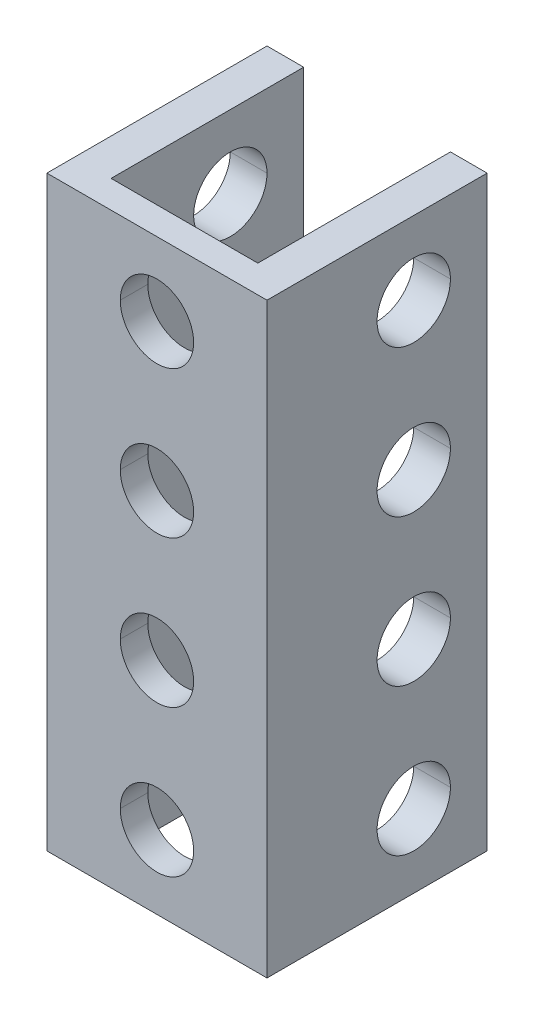
ISO-10303-21;
HEADER;
FILE_DESCRIPTION(('STEP AP214'),'2;1');
FILE_NAME('part.step','',(''),(''),'','','');
FILE_SCHEMA(('AUTOMOTIVE_DESIGN { 1 0 10303 214 1 1 1 1 }'));
ENDSEC;
DATA;
#1=APPLICATION_CONTEXT('core data for automotive mechanical design processes');
#2=APPLICATION_PROTOCOL_DEFINITION('international standard','automotive_design',2000,#1);
#3=PRODUCT_CONTEXT('',#1,'mechanical');
#4=PRODUCT('Part','Part','',(#3));
#5=PRODUCT_RELATED_PRODUCT_CATEGORY('part','',(#4));
#6=PRODUCT_DEFINITION_FORMATION('','',#4);
#7=PRODUCT_DEFINITION_CONTEXT('part definition',#1,'design');
#8=PRODUCT_DEFINITION('design','',#6,#7);
#9=PRODUCT_DEFINITION_SHAPE('','',#8);
#10=(LENGTH_UNIT() NAMED_UNIT(*) SI_UNIT(.MILLI.,.METRE.));
#11=(NAMED_UNIT(*) PLANE_ANGLE_UNIT() SI_UNIT($,.RADIAN.));
#12=(NAMED_UNIT(*) SI_UNIT($,.STERADIAN.) SOLID_ANGLE_UNIT());
#13=UNCERTAINTY_MEASURE_WITH_UNIT(LENGTH_MEASURE(1.E-05),#10,'distance_accuracy_value','');
#14=(GEOMETRIC_REPRESENTATION_CONTEXT(3) GLOBAL_UNCERTAINTY_ASSIGNED_CONTEXT((#13)) GLOBAL_UNIT_ASSIGNED_CONTEXT((#10,
#11,#12)) REPRESENTATION_CONTEXT('',''));
#15=CARTESIAN_POINT('',(0.,0.,0.));
#16=DIRECTION('',(0.,0.,1.));
#17=DIRECTION('',(1.,0.,0.));
#18=AXIS2_PLACEMENT_3D('',#15,#16,#17);
#19=CARTESIAN_POINT('',(0.,28.,1.5));
#20=DIRECTION('',(0.,0.,1.));
#21=DIRECTION('',(1.,0.,0.));
#22=AXIS2_PLACEMENT_3D('',#19,#20,#21);
#23=CYLINDRICAL_SURFACE('',#22,2.);
#24=DIRECTION('',(0.,0.,1.));
#25=VECTOR('',#24,1.);
#26=CARTESIAN_POINT('',(-2.,28.,1.5));
#27=LINE('',#26,#25);
#28=CARTESIAN_POINT('',(-2.,28.,0.));
#29=VERTEX_POINT('',#28);
#30=CARTESIAN_POINT('',(-2.,28.,1.5));
#31=VERTEX_POINT('',#30);
#32=EDGE_CURVE('E436',#29,#31,#27,.T.);
#33=ORIENTED_EDGE('',*,*,#32,.F.);
#34=CARTESIAN_POINT('',(0.,28.,0.));
#35=DIRECTION('',(0.,0.,1.));
#36=DIRECTION('',(1.,0.,0.));
#37=AXIS2_PLACEMENT_3D('',#34,#35,#36);
#38=CIRCLE('',#37,2.);
#39=CARTESIAN_POINT('',(2.,28.,0.));
#40=VERTEX_POINT('',#39);
#41=EDGE_CURVE('E483',#40,#29,#38,.T.);
#42=ORIENTED_EDGE('',*,*,#41,.F.);
#43=DIRECTION('',(0.,0.,1.));
#44=VECTOR('',#43,1.);
#45=CARTESIAN_POINT('',(2.,28.,1.5));
#46=LINE('',#45,#44);
#47=CARTESIAN_POINT('',(2.,28.,1.5));
#48=VERTEX_POINT('',#47);
#49=EDGE_CURVE('E472',#40,#48,#46,.T.);
#50=ORIENTED_EDGE('',*,*,#49,.T.);
#51=CARTESIAN_POINT('',(0.,28.,1.5));
#52=DIRECTION('',(0.,0.,1.));
#53=DIRECTION('',(1.,0.,0.));
#54=AXIS2_PLACEMENT_3D('',#51,#52,#53);
#55=CIRCLE('',#54,2.);
#56=EDGE_CURVE('E330',#48,#31,#55,.T.);
#57=ORIENTED_EDGE('',*,*,#56,.T.);
#58=EDGE_LOOP('',(#33,#42,#50,#57));
#59=FACE_BOUND('',#58,.T.);
#60=ADVANCED_FACE('F15',(#59),#23,.F.);
#61=CARTESIAN_POINT('',(0.,20.,1.5));
#62=DIRECTION('',(0.,0.,1.));
#63=DIRECTION('',(1.,0.,0.));
#64=AXIS2_PLACEMENT_3D('',#61,#62,#63);
#65=CYLINDRICAL_SURFACE('',#64,2.);
#66=DIRECTION('',(0.,0.,1.));
#67=VECTOR('',#66,1.);
#68=CARTESIAN_POINT('',(-2.,20.,1.5));
#69=LINE('',#68,#67);
#70=CARTESIAN_POINT('',(-2.,20.,0.));
#71=VERTEX_POINT('',#70);
#72=CARTESIAN_POINT('',(-2.,20.,1.5));
#73=VERTEX_POINT('',#72);
#74=EDGE_CURVE('E471',#71,#73,#69,.T.);
#75=ORIENTED_EDGE('',*,*,#74,.F.);
#76=CARTESIAN_POINT('',(0.,20.,0.));
#77=DIRECTION('',(0.,0.,1.));
#78=DIRECTION('',(1.,0.,0.));
#79=AXIS2_PLACEMENT_3D('',#76,#77,#78);
#80=CIRCLE('',#79,2.);
#81=CARTESIAN_POINT('',(2.,20.,0.));
#82=VERTEX_POINT('',#81);
#83=EDGE_CURVE('E486',#82,#71,#80,.T.);
#84=ORIENTED_EDGE('',*,*,#83,.F.);
#85=DIRECTION('',(0.,0.,1.));
#86=VECTOR('',#85,1.);
#87=CARTESIAN_POINT('',(2.,20.,1.5));
#88=LINE('',#87,#86);
#89=CARTESIAN_POINT('',(2.,20.,1.5));
#90=VERTEX_POINT('',#89);
#91=EDGE_CURVE('E427',#82,#90,#88,.T.);
#92=ORIENTED_EDGE('',*,*,#91,.T.);
#93=CARTESIAN_POINT('',(0.,20.,1.5));
#94=DIRECTION('',(0.,0.,1.));
#95=DIRECTION('',(1.,0.,0.));
#96=AXIS2_PLACEMENT_3D('',#93,#94,#95);
#97=CIRCLE('',#96,2.);
#98=EDGE_CURVE('E445',#90,#73,#97,.T.);
#99=ORIENTED_EDGE('',*,*,#98,.T.);
#100=EDGE_LOOP('',(#75,#84,#92,#99));
#101=FACE_BOUND('',#100,.T.);
#102=ADVANCED_FACE('F732',(#101),#65,.F.);
#103=CARTESIAN_POINT('',(0.,12.,1.5));
#104=DIRECTION('',(0.,0.,1.));
#105=DIRECTION('',(1.,0.,0.));
#106=AXIS2_PLACEMENT_3D('',#103,#104,#105);
#107=CYLINDRICAL_SURFACE('',#106,2.);
#108=DIRECTION('',(0.,0.,1.));
#109=VECTOR('',#108,1.);
#110=CARTESIAN_POINT('',(-2.,12.,1.5));
#111=LINE('',#110,#109);
#112=CARTESIAN_POINT('',(-2.,12.,0.));
#113=VERTEX_POINT('',#112);
#114=CARTESIAN_POINT('',(-2.,12.,1.5));
#115=VERTEX_POINT('',#114);
#116=EDGE_CURVE('E333',#113,#115,#111,.T.);
#117=ORIENTED_EDGE('',*,*,#116,.F.);
#118=CARTESIAN_POINT('',(0.,12.,0.));
#119=DIRECTION('',(0.,0.,1.));
#120=DIRECTION('',(1.,0.,0.));
#121=AXIS2_PLACEMENT_3D('',#118,#119,#120);
#122=CIRCLE('',#121,2.);
#123=CARTESIAN_POINT('',(2.,12.,0.));
#124=VERTEX_POINT('',#123);
#125=EDGE_CURVE('E26',#124,#113,#122,.T.);
#126=ORIENTED_EDGE('',*,*,#125,.F.);
#127=DIRECTION('',(0.,0.,1.));
#128=VECTOR('',#127,1.);
#129=CARTESIAN_POINT('',(2.,12.,1.5));
#130=LINE('',#129,#128);
#131=CARTESIAN_POINT('',(2.,12.,1.5));
#132=VERTEX_POINT('',#131);
#133=EDGE_CURVE('E390',#124,#132,#130,.T.);
#134=ORIENTED_EDGE('',*,*,#133,.T.);
#135=CARTESIAN_POINT('',(0.,12.,1.5));
#136=DIRECTION('',(0.,0.,1.));
#137=DIRECTION('',(1.,0.,0.));
#138=AXIS2_PLACEMENT_3D('',#135,#136,#137);
#139=CIRCLE('',#138,2.);
#140=EDGE_CURVE('E448',#132,#115,#139,.T.);
#141=ORIENTED_EDGE('',*,*,#140,.T.);
#142=EDGE_LOOP('',(#117,#126,#134,#141));
#143=FACE_BOUND('',#142,.T.);
#144=ADVANCED_FACE('F845',(#143),#107,.F.);
#145=CARTESIAN_POINT('',(-6.,28.,-6.5));
#146=DIRECTION('',(-1.,0.,0.));
#147=DIRECTION('',(0.,0.,1.));
#148=AXIS2_PLACEMENT_3D('',#145,#146,#147);
#149=CYLINDRICAL_SURFACE('',#148,2.);
#150=DIRECTION('',(-1.,0.,0.));
#151=VECTOR('',#150,1.);
#152=CARTESIAN_POINT('',(-6.,28.,-8.5));
#153=LINE('',#152,#151);
#154=CARTESIAN_POINT('',(6.,28.,-8.5));
#155=VERTEX_POINT('',#154);
#156=CARTESIAN_POINT('',(4.,28.,-8.5));
#157=VERTEX_POINT('',#156);
#158=EDGE_CURVE('E389',#155,#157,#153,.T.);
#159=ORIENTED_EDGE('',*,*,#158,.F.);
#160=CARTESIAN_POINT('',(6.,28.,-6.5));
#161=DIRECTION('',(-1.,0.,0.));
#162=DIRECTION('',(0.,0.,1.));
#163=AXIS2_PLACEMENT_3D('',#160,#161,#162);
#164=CIRCLE('',#163,2.);
#165=CARTESIAN_POINT('',(6.,28.,-4.5));
#166=VERTEX_POINT('',#165);
#167=EDGE_CURVE('E350',#166,#155,#164,.T.);
#168=ORIENTED_EDGE('',*,*,#167,.F.);
#169=DIRECTION('',(-1.,0.,0.));
#170=VECTOR('',#169,1.);
#171=CARTESIAN_POINT('',(-6.,28.,-4.5));
#172=LINE('',#171,#170);
#173=CARTESIAN_POINT('',(4.,28.,-4.5));
#174=VERTEX_POINT('',#173);
#175=EDGE_CURVE('E365',#166,#174,#172,.T.);
#176=ORIENTED_EDGE('',*,*,#175,.T.);
#177=CARTESIAN_POINT('',(4.,28.,-6.5));
#178=DIRECTION('',(1.,0.,0.));
#179=DIRECTION('',(0.,0.,-1.));
#180=AXIS2_PLACEMENT_3D('',#177,#178,#179);
#181=CIRCLE('',#180,2.);
#182=EDGE_CURVE('E455',#157,#174,#181,.T.);
#183=ORIENTED_EDGE('',*,*,#182,.F.);
#184=EDGE_LOOP('',(#159,#168,#176,#183));
#185=FACE_BOUND('',#184,.T.);
#186=ADVANCED_FACE('F840',(#185),#149,.F.);
#187=CARTESIAN_POINT('',(-6.,20.,-6.5));
#188=DIRECTION('',(-1.,0.,0.));
#189=DIRECTION('',(0.,0.,1.));
#190=AXIS2_PLACEMENT_3D('',#187,#188,#189);
#191=CYLINDRICAL_SURFACE('',#190,2.);
#192=DIRECTION('',(-1.,0.,0.));
#193=VECTOR('',#192,1.);
#194=CARTESIAN_POINT('',(-6.,20.,-8.5));
#195=LINE('',#194,#193);
#196=CARTESIAN_POINT('',(6.,20.,-8.5));
#197=VERTEX_POINT('',#196);
#198=CARTESIAN_POINT('',(4.,20.,-8.5));
#199=VERTEX_POINT('',#198);
#200=EDGE_CURVE('E364',#197,#199,#195,.T.);
#201=ORIENTED_EDGE('',*,*,#200,.F.);
#202=CARTESIAN_POINT('',(6.,20.,-6.5));
#203=DIRECTION('',(-1.,0.,0.));
#204=DIRECTION('',(0.,0.,1.));
#205=AXIS2_PLACEMENT_3D('',#202,#203,#204);
#206=CIRCLE('',#205,2.);
#207=CARTESIAN_POINT('',(6.,20.,-4.5));
#208=VERTEX_POINT('',#207);
#209=EDGE_CURVE('E354',#208,#197,#206,.T.);
#210=ORIENTED_EDGE('',*,*,#209,.F.);
#211=DIRECTION('',(-1.,0.,0.));
#212=VECTOR('',#211,1.);
#213=CARTESIAN_POINT('',(-6.,20.,-4.5));
#214=LINE('',#213,#212);
#215=CARTESIAN_POINT('',(4.,20.,-4.5));
#216=VERTEX_POINT('',#215);
#217=EDGE_CURVE('E510',#208,#216,#214,.T.);
#218=ORIENTED_EDGE('',*,*,#217,.T.);
#219=CARTESIAN_POINT('',(4.,20.,-6.5));
#220=DIRECTION('',(1.,0.,0.));
#221=DIRECTION('',(0.,0.,-1.));
#222=AXIS2_PLACEMENT_3D('',#219,#220,#221);
#223=CIRCLE('',#222,2.);
#224=EDGE_CURVE('E326',#199,#216,#223,.T.);
#225=ORIENTED_EDGE('',*,*,#224,.F.);
#226=EDGE_LOOP('',(#201,#210,#218,#225));
#227=FACE_BOUND('',#226,.T.);
#228=ADVANCED_FACE('F805',(#227),#191,.F.);
#229=CARTESIAN_POINT('',(-6.,12.,-6.5));
#230=DIRECTION('',(-1.,0.,0.));
#231=DIRECTION('',(0.,0.,1.));
#232=AXIS2_PLACEMENT_3D('',#229,#230,#231);
#233=CYLINDRICAL_SURFACE('',#232,2.);
#234=DIRECTION('',(-1.,0.,0.));
#235=VECTOR('',#234,1.);
#236=CARTESIAN_POINT('',(-6.,12.,-8.5));
#237=LINE('',#236,#235);
#238=CARTESIAN_POINT('',(6.,12.,-8.5));
#239=VERTEX_POINT('',#238);
#240=CARTESIAN_POINT('',(4.,12.,-8.5));
#241=VERTEX_POINT('',#240);
#242=EDGE_CURVE('E509',#239,#241,#237,.T.);
#243=ORIENTED_EDGE('',*,*,#242,.F.);
#244=CARTESIAN_POINT('',(6.,12.,-6.5));
#245=DIRECTION('',(-1.,0.,0.));
#246=DIRECTION('',(0.,0.,1.));
#247=AXIS2_PLACEMENT_3D('',#244,#245,#246);
#248=CIRCLE('',#247,2.);
#249=CARTESIAN_POINT('',(6.,12.,-4.5));
#250=VERTEX_POINT('',#249);
#251=EDGE_CURVE('E539',#250,#239,#248,.T.);
#252=ORIENTED_EDGE('',*,*,#251,.F.);
#253=DIRECTION('',(-1.,0.,0.));
#254=VECTOR('',#253,1.);
#255=CARTESIAN_POINT('',(-6.,12.,-4.5));
#256=LINE('',#255,#254);
#257=CARTESIAN_POINT('',(4.,12.,-4.5));
#258=VERTEX_POINT('',#257);
#259=EDGE_CURVE('E417',#250,#258,#256,.T.);
#260=ORIENTED_EDGE('',*,*,#259,.T.);
#261=CARTESIAN_POINT('',(4.,12.,-6.5));
#262=DIRECTION('',(1.,0.,0.));
#263=DIRECTION('',(0.,0.,-1.));
#264=AXIS2_PLACEMENT_3D('',#261,#262,#263);
#265=CIRCLE('',#264,2.);
#266=EDGE_CURVE('E397',#241,#258,#265,.T.);
#267=ORIENTED_EDGE('',*,*,#266,.F.);
#268=EDGE_LOOP('',(#243,#252,#260,#267));
#269=FACE_BOUND('',#268,.T.);
#270=ADVANCED_FACE('F799',(#269),#233,.F.);
#271=CARTESIAN_POINT('',(-6.,28.,-6.5));
#272=DIRECTION('',(-1.,0.,0.));
#273=DIRECTION('',(0.,0.,1.));
#274=AXIS2_PLACEMENT_3D('',#271,#272,#273);
#275=CYLINDRICAL_SURFACE('',#274,2.);
#276=DIRECTION('',(-1.,0.,0.));
#277=VECTOR('',#276,1.);
#278=CARTESIAN_POINT('',(-6.,28.,-8.5));
#279=LINE('',#278,#277);
#280=CARTESIAN_POINT('',(-4.,28.,-8.5));
#281=VERTEX_POINT('',#280);
#282=CARTESIAN_POINT('',(-6.,28.,-8.5));
#283=VERTEX_POINT('',#282);
#284=EDGE_CURVE('E476',#281,#283,#279,.T.);
#285=ORIENTED_EDGE('',*,*,#284,.F.);
#286=CARTESIAN_POINT('',(-4.,28.,-6.5));
#287=DIRECTION('',(-1.,0.,0.));
#288=DIRECTION('',(0.,0.,1.));
#289=AXIS2_PLACEMENT_3D('',#286,#287,#288);
#290=CIRCLE('',#289,2.);
#291=CARTESIAN_POINT('',(-4.,28.,-4.5));
#292=VERTEX_POINT('',#291);
#293=EDGE_CURVE('E345',#292,#281,#290,.T.);
#294=ORIENTED_EDGE('',*,*,#293,.F.);
#295=DIRECTION('',(-1.,0.,0.));
#296=VECTOR('',#295,1.);
#297=CARTESIAN_POINT('',(-6.,28.,-4.5));
#298=LINE('',#297,#296);
#299=CARTESIAN_POINT('',(-6.,28.,-4.5));
#300=VERTEX_POINT('',#299);
#301=EDGE_CURVE('E487',#292,#300,#298,.T.);
#302=ORIENTED_EDGE('',*,*,#301,.T.);
#303=CARTESIAN_POINT('',(-6.,28.,-6.5));
#304=DIRECTION('',(-1.,0.,0.));
#305=DIRECTION('',(0.,0.,1.));
#306=AXIS2_PLACEMENT_3D('',#303,#304,#305);
#307=CIRCLE('',#306,2.);
#308=EDGE_CURVE('E370',#300,#283,#307,.T.);
#309=ORIENTED_EDGE('',*,*,#308,.T.);
#310=EDGE_LOOP('',(#285,#294,#302,#309));
#311=FACE_BOUND('',#310,.T.);
#312=ADVANCED_FACE('F804',(#311),#275,.F.);
#313=CARTESIAN_POINT('',(-6.,20.,-6.5));
#314=DIRECTION('',(-1.,0.,0.));
#315=DIRECTION('',(0.,0.,1.));
#316=AXIS2_PLACEMENT_3D('',#313,#314,#315);
#317=CYLINDRICAL_SURFACE('',#316,2.);
#318=DIRECTION('',(-1.,0.,0.));
#319=VECTOR('',#318,1.);
#320=CARTESIAN_POINT('',(-6.,20.,-8.5));
#321=LINE('',#320,#319);
#322=CARTESIAN_POINT('',(-4.,20.,-8.5));
#323=VERTEX_POINT('',#322);
#324=CARTESIAN_POINT('',(-6.,20.,-8.5));
#325=VERTEX_POINT('',#324);
#326=EDGE_CURVE('E544',#323,#325,#321,.T.);
#327=ORIENTED_EDGE('',*,*,#326,.F.);
#328=CARTESIAN_POINT('',(-4.,20.,-6.5));
#329=DIRECTION('',(-1.,0.,0.));
#330=DIRECTION('',(0.,0.,1.));
#331=AXIS2_PLACEMENT_3D('',#328,#329,#330);
#332=CIRCLE('',#331,2.);
#333=CARTESIAN_POINT('',(-4.,20.,-4.5));
#334=VERTEX_POINT('',#333);
#335=EDGE_CURVE('E349',#334,#323,#332,.T.);
#336=ORIENTED_EDGE('',*,*,#335,.F.);
#337=DIRECTION('',(-1.,0.,0.));
#338=VECTOR('',#337,1.);
#339=CARTESIAN_POINT('',(-6.,20.,-4.5));
#340=LINE('',#339,#338);
#341=CARTESIAN_POINT('',(-6.,20.,-4.5));
#342=VERTEX_POINT('',#341);
#343=EDGE_CURVE('E578',#334,#342,#340,.T.);
#344=ORIENTED_EDGE('',*,*,#343,.T.);
#345=CARTESIAN_POINT('',(-6.,20.,-6.5));
#346=DIRECTION('',(-1.,0.,0.));
#347=DIRECTION('',(0.,0.,1.));
#348=AXIS2_PLACEMENT_3D('',#345,#346,#347);
#349=CIRCLE('',#348,2.);
#350=EDGE_CURVE('E303',#342,#325,#349,.T.);
#351=ORIENTED_EDGE('',*,*,#350,.T.);
#352=EDGE_LOOP('',(#327,#336,#344,#351));
#353=FACE_BOUND('',#352,.T.);
#354=ADVANCED_FACE('F886',(#353),#317,.F.);
#355=CARTESIAN_POINT('',(-6.,12.,-6.5));
#356=DIRECTION('',(-1.,0.,0.));
#357=DIRECTION('',(0.,0.,1.));
#358=AXIS2_PLACEMENT_3D('',#355,#356,#357);
#359=CYLINDRICAL_SURFACE('',#358,2.);
#360=DIRECTION('',(-1.,0.,0.));
#361=VECTOR('',#360,1.);
#362=CARTESIAN_POINT('',(-6.,12.,-8.5));
#363=LINE('',#362,#361);
#364=CARTESIAN_POINT('',(-4.,12.,-8.5));
#365=VERTEX_POINT('',#364);
#366=CARTESIAN_POINT('',(-6.,12.,-8.5));
#367=VERTEX_POINT('',#366);
#368=EDGE_CURVE('E549',#365,#367,#363,.T.);
#369=ORIENTED_EDGE('',*,*,#368,.F.);
#370=CARTESIAN_POINT('',(-4.,12.,-6.5));
#371=DIRECTION('',(-1.,0.,0.));
#372=DIRECTION('',(0.,0.,1.));
#373=AXIS2_PLACEMENT_3D('',#370,#371,#372);
#374=CIRCLE('',#373,2.);
#375=CARTESIAN_POINT('',(-4.,12.,-4.5));
#376=VERTEX_POINT('',#375);
#377=EDGE_CURVE('E355',#376,#365,#374,.T.);
#378=ORIENTED_EDGE('',*,*,#377,.F.);
#379=DIRECTION('',(-1.,0.,0.));
#380=VECTOR('',#379,1.);
#381=CARTESIAN_POINT('',(-6.,12.,-4.5));
#382=LINE('',#381,#380);
#383=CARTESIAN_POINT('',(-6.,12.,-4.5));
#384=VERTEX_POINT('',#383);
#385=EDGE_CURVE('E535',#376,#384,#382,.T.);
#386=ORIENTED_EDGE('',*,*,#385,.T.);
#387=CARTESIAN_POINT('',(-6.,12.,-6.5));
#388=DIRECTION('',(-1.,0.,0.));
#389=DIRECTION('',(0.,0.,1.));
#390=AXIS2_PLACEMENT_3D('',#387,#388,#389);
#391=CIRCLE('',#390,2.);
#392=EDGE_CURVE('E304',#384,#367,#391,.T.);
#393=ORIENTED_EDGE('',*,*,#392,.T.);
#394=EDGE_LOOP('',(#369,#378,#386,#393));
#395=FACE_BOUND('',#394,.T.);
#396=ADVANCED_FACE('F697',(#395),#359,.F.);
#397=CARTESIAN_POINT('',(0.,32.,0.));
#398=DIRECTION('',(0.,1.,0.));
#399=DIRECTION('',(1.,0.,0.));
#400=AXIS2_PLACEMENT_3D('',#397,#398,#399);
#401=PLANE('',#400);
#402=DIRECTION('',(0.,0.,-1.));
#403=VECTOR('',#402,1.);
#404=CARTESIAN_POINT('',(-4.,32.,0.));
#405=LINE('',#404,#403);
#406=CARTESIAN_POINT('',(-4.,32.,0.));
#407=VERTEX_POINT('',#406);
#408=CARTESIAN_POINT('',(-4.,32.,-10.5));
#409=VERTEX_POINT('',#408);
#410=EDGE_CURVE('E480',#407,#409,#405,.T.);
#411=ORIENTED_EDGE('',*,*,#410,.T.);
#412=DIRECTION('',(-1.,0.,0.));
#413=VECTOR('',#412,1.);
#414=CARTESIAN_POINT('',(-4.,32.,-10.5));
#415=LINE('',#414,#413);
#416=CARTESIAN_POINT('',(-6.,32.,-10.5));
#417=VERTEX_POINT('',#416);
#418=EDGE_CURVE('E374',#409,#417,#415,.T.);
#419=ORIENTED_EDGE('',*,*,#418,.T.);
#420=DIRECTION('',(0.,0.,1.));
#421=VECTOR('',#420,1.);
#422=CARTESIAN_POINT('',(-6.,32.,-10.5));
#423=LINE('',#422,#421);
#424=CARTESIAN_POINT('',(-6.,32.,1.5));
#425=VERTEX_POINT('',#424);
#426=EDGE_CURVE('E520',#417,#425,#423,.T.);
#427=ORIENTED_EDGE('',*,*,#426,.T.);
#428=DIRECTION('',(1.,0.,0.));
#429=VECTOR('',#428,1.);
#430=CARTESIAN_POINT('',(-6.,32.,1.5));
#431=LINE('',#430,#429);
#432=CARTESIAN_POINT('',(6.,32.,1.5));
#433=VERTEX_POINT('',#432);
#434=EDGE_CURVE('E328',#425,#433,#431,.T.);
#435=ORIENTED_EDGE('',*,*,#434,.T.);
#436=DIRECTION('',(0.,0.,-1.));
#437=VECTOR('',#436,1.);
#438=CARTESIAN_POINT('',(6.,32.,-10.5));
#439=LINE('',#438,#437);
#440=CARTESIAN_POINT('',(6.,32.,-10.5));
#441=VERTEX_POINT('',#440);
#442=EDGE_CURVE('E461',#433,#441,#439,.T.);
#443=ORIENTED_EDGE('',*,*,#442,.T.);
#444=DIRECTION('',(-1.,0.,0.));
#445=VECTOR('',#444,1.);
#446=CARTESIAN_POINT('',(4.,32.,-10.5));
#447=LINE('',#446,#445);
#448=CARTESIAN_POINT('',(4.,32.,-10.5));
#449=VERTEX_POINT('',#448);
#450=EDGE_CURVE('E569',#441,#449,#447,.T.);
#451=ORIENTED_EDGE('',*,*,#450,.T.);
#452=DIRECTION('',(0.,0.,1.));
#453=VECTOR('',#452,1.);
#454=CARTESIAN_POINT('',(4.,32.,0.));
#455=LINE('',#454,#453);
#456=CARTESIAN_POINT('',(4.,32.,0.));
#457=VERTEX_POINT('',#456);
#458=EDGE_CURVE('E401',#449,#457,#455,.T.);
#459=ORIENTED_EDGE('',*,*,#458,.T.);
#460=DIRECTION('',(-1.,0.,0.));
#461=VECTOR('',#460,1.);
#462=CARTESIAN_POINT('',(4.,32.,0.));
#463=LINE('',#462,#461);
#464=EDGE_CURVE('E40',#457,#407,#463,.T.);
#465=ORIENTED_EDGE('',*,*,#464,.T.);
#466=EDGE_LOOP('',(#411,#419,#427,#435,#443,#451,#459,#465));
#467=FACE_BOUND('',#466,.T.);
#468=ADVANCED_FACE('F605',(#467),#401,.T.);
#469=CARTESIAN_POINT('',(0.,4.,1.5));
#470=DIRECTION('',(0.,0.,1.));
#471=DIRECTION('',(1.,0.,0.));
#472=AXIS2_PLACEMENT_3D('',#469,#470,#471);
#473=CYLINDRICAL_SURFACE('',#472,2.);
#474=DIRECTION('',(0.,0.,1.));
#475=VECTOR('',#474,1.);
#476=CARTESIAN_POINT('',(-2.,4.,1.5));
#477=LINE('',#476,#475);
#478=CARTESIAN_POINT('',(-2.,4.,0.));
#479=VERTEX_POINT('',#478);
#480=CARTESIAN_POINT('',(-2.,4.,1.5));
#481=VERTEX_POINT('',#480);
#482=EDGE_CURVE('E501',#479,#481,#477,.T.);
#483=ORIENTED_EDGE('',*,*,#482,.F.);
#484=CARTESIAN_POINT('',(0.,4.,0.));
#485=DIRECTION('',(0.,0.,1.));
#486=DIRECTION('',(1.,0.,0.));
#487=AXIS2_PLACEMENT_3D('',#484,#485,#486);
#488=CIRCLE('',#487,2.);
#489=CARTESIAN_POINT('',(2.,4.,0.));
#490=VERTEX_POINT('',#489);
#491=EDGE_CURVE('E10',#490,#479,#488,.T.);
#492=ORIENTED_EDGE('',*,*,#491,.F.);
#493=DIRECTION('',(0.,0.,1.));
#494=VECTOR('',#493,1.);
#495=CARTESIAN_POINT('',(2.,4.,1.5));
#496=LINE('',#495,#494);
#497=CARTESIAN_POINT('',(2.,4.,1.5));
#498=VERTEX_POINT('',#497);
#499=EDGE_CURVE('E322',#490,#498,#496,.T.);
#500=ORIENTED_EDGE('',*,*,#499,.T.);
#501=CARTESIAN_POINT('',(0.,4.,1.5));
#502=DIRECTION('',(0.,0.,1.));
#503=DIRECTION('',(1.,0.,0.));
#504=AXIS2_PLACEMENT_3D('',#501,#502,#503);
#505=CIRCLE('',#504,2.);
#506=EDGE_CURVE('E416',#498,#481,#505,.T.);
#507=ORIENTED_EDGE('',*,*,#506,.T.);
#508=EDGE_LOOP('',(#483,#492,#500,#507));
#509=FACE_BOUND('',#508,.T.);
#510=ADVANCED_FACE('F696',(#509),#473,.F.);
#511=CARTESIAN_POINT('',(-6.,4.,-6.5));
#512=DIRECTION('',(-1.,0.,0.));
#513=DIRECTION('',(0.,0.,1.));
#514=AXIS2_PLACEMENT_3D('',#511,#512,#513);
#515=CYLINDRICAL_SURFACE('',#514,2.);
#516=DIRECTION('',(-1.,0.,0.));
#517=VECTOR('',#516,1.);
#518=CARTESIAN_POINT('',(-6.,4.,-8.5));
#519=LINE('',#518,#517);
#520=CARTESIAN_POINT('',(-4.,4.,-8.5));
#521=VERTEX_POINT('',#520);
#522=CARTESIAN_POINT('',(-6.,4.,-8.5));
#523=VERTEX_POINT('',#522);
#524=EDGE_CURVE('E296',#521,#523,#519,.T.);
#525=ORIENTED_EDGE('',*,*,#524,.F.);
#526=CARTESIAN_POINT('',(-4.,4.,-6.5));
#527=DIRECTION('',(-1.,0.,0.));
#528=DIRECTION('',(0.,0.,1.));
#529=AXIS2_PLACEMENT_3D('',#526,#527,#528);
#530=CIRCLE('',#529,2.);
#531=CARTESIAN_POINT('',(-4.,4.,-4.5));
#532=VERTEX_POINT('',#531);
#533=EDGE_CURVE('E358',#532,#521,#530,.T.);
#534=ORIENTED_EDGE('',*,*,#533,.F.);
#535=DIRECTION('',(-1.,0.,0.));
#536=VECTOR('',#535,1.);
#537=CARTESIAN_POINT('',(-6.,4.,-4.5));
#538=LINE('',#537,#536);
#539=CARTESIAN_POINT('',(-6.,4.,-4.5));
#540=VERTEX_POINT('',#539);
#541=EDGE_CURVE('E299',#532,#540,#538,.T.);
#542=ORIENTED_EDGE('',*,*,#541,.T.);
#543=CARTESIAN_POINT('',(-6.,4.,-6.5));
#544=DIRECTION('',(-1.,0.,0.));
#545=DIRECTION('',(0.,0.,1.));
#546=AXIS2_PLACEMENT_3D('',#543,#544,#545);
#547=CIRCLE('',#546,2.);
#548=EDGE_CURVE('E292',#540,#523,#547,.T.);
#549=ORIENTED_EDGE('',*,*,#548,.T.);
#550=EDGE_LOOP('',(#525,#534,#542,#549));
#551=FACE_BOUND('',#550,.T.);
#552=ADVANCED_FACE('F294',(#551),#515,.F.);
#553=CARTESIAN_POINT('',(-6.,4.,-6.5));
#554=DIRECTION('',(-1.,0.,0.));
#555=DIRECTION('',(0.,0.,1.));
#556=AXIS2_PLACEMENT_3D('',#553,#554,#555);
#557=CYLINDRICAL_SURFACE('',#556,2.);
#558=DIRECTION('',(-1.,0.,0.));
#559=VECTOR('',#558,1.);
#560=CARTESIAN_POINT('',(-6.,4.,-8.5));
#561=LINE('',#560,#559);
#562=CARTESIAN_POINT('',(6.,4.,-8.5));
#563=VERTEX_POINT('',#562);
#564=CARTESIAN_POINT('',(4.,4.,-8.5));
#565=VERTEX_POINT('',#564);
#566=EDGE_CURVE('E380',#563,#565,#561,.T.);
#567=ORIENTED_EDGE('',*,*,#566,.F.);
#568=CARTESIAN_POINT('',(6.,4.,-6.5));
#569=DIRECTION('',(-1.,0.,0.));
#570=DIRECTION('',(0.,0.,1.));
#571=AXIS2_PLACEMENT_3D('',#568,#569,#570);
#572=CIRCLE('',#571,2.);
#573=CARTESIAN_POINT('',(6.,4.,-4.5));
#574=VERTEX_POINT('',#573);
#575=EDGE_CURVE('E530',#574,#563,#572,.T.);
#576=ORIENTED_EDGE('',*,*,#575,.F.);
#577=DIRECTION('',(-1.,0.,0.));
#578=VECTOR('',#577,1.);
#579=CARTESIAN_POINT('',(-6.,4.,-4.5));
#580=LINE('',#579,#578);
#581=CARTESIAN_POINT('',(4.,4.,-4.5));
#582=VERTEX_POINT('',#581);
#583=EDGE_CURVE('E339',#574,#582,#580,.T.);
#584=ORIENTED_EDGE('',*,*,#583,.T.);
#585=CARTESIAN_POINT('',(4.,4.,-6.5));
#586=DIRECTION('',(1.,0.,0.));
#587=DIRECTION('',(0.,0.,-1.));
#588=AXIS2_PLACEMENT_3D('',#585,#586,#587);
#589=CIRCLE('',#588,2.);
#590=EDGE_CURVE('E400',#565,#582,#589,.T.);
#591=ORIENTED_EDGE('',*,*,#590,.F.);
#592=EDGE_LOOP('',(#567,#576,#584,#591));
#593=FACE_BOUND('',#592,.T.);
#594=ADVANCED_FACE('F720',(#593),#557,.F.);
#595=CARTESIAN_POINT('',(0.,0.,0.));
#596=DIRECTION('',(0.,1.,0.));
#597=DIRECTION('',(1.,0.,0.));
#598=AXIS2_PLACEMENT_3D('',#595,#596,#597);
#599=PLANE('',#598);
#600=DIRECTION('',(0.,0.,-1.));
#601=VECTOR('',#600,1.);
#602=CARTESIAN_POINT('',(-4.,0.,0.));
#603=LINE('',#602,#601);
#604=CARTESIAN_POINT('',(-4.,0.,0.));
#605=VERTEX_POINT('',#604);
#606=CARTESIAN_POINT('',(-4.,0.,-10.5));
#607=VERTEX_POINT('',#606);
#608=EDGE_CURVE('E343',#605,#607,#603,.T.);
#609=ORIENTED_EDGE('',*,*,#608,.F.);
#610=DIRECTION('',(-1.,0.,0.));
#611=VECTOR('',#610,1.);
#612=CARTESIAN_POINT('',(4.,0.,0.));
#613=LINE('',#612,#611);
#614=CARTESIAN_POINT('',(4.,0.,0.));
#615=VERTEX_POINT('',#614);
#616=EDGE_CURVE('E452',#615,#605,#613,.T.);
#617=ORIENTED_EDGE('',*,*,#616,.F.);
#618=DIRECTION('',(0.,0.,1.));
#619=VECTOR('',#618,1.);
#620=CARTESIAN_POINT('',(4.,0.,0.));
#621=LINE('',#620,#619);
#622=CARTESIAN_POINT('',(4.,0.,-10.5));
#623=VERTEX_POINT('',#622);
#624=EDGE_CURVE('E565',#623,#615,#621,.T.);
#625=ORIENTED_EDGE('',*,*,#624,.F.);
#626=DIRECTION('',(-1.,0.,0.));
#627=VECTOR('',#626,1.);
#628=CARTESIAN_POINT('',(4.,0.,-10.5));
#629=LINE('',#628,#627);
#630=CARTESIAN_POINT('',(6.,0.,-10.5));
#631=VERTEX_POINT('',#630);
#632=EDGE_CURVE('E353',#631,#623,#629,.T.);
#633=ORIENTED_EDGE('',*,*,#632,.F.);
#634=DIRECTION('',(0.,0.,-1.));
#635=VECTOR('',#634,1.);
#636=CARTESIAN_POINT('',(6.,0.,-10.5));
#637=LINE('',#636,#635);
#638=CARTESIAN_POINT('',(6.,0.,1.5));
#639=VERTEX_POINT('',#638);
#640=EDGE_CURVE('E411',#639,#631,#637,.T.);
#641=ORIENTED_EDGE('',*,*,#640,.F.);
#642=DIRECTION('',(1.,0.,0.));
#643=VECTOR('',#642,1.);
#644=CARTESIAN_POINT('',(-6.,0.,1.5));
#645=LINE('',#644,#643);
#646=CARTESIAN_POINT('',(-6.,0.,1.5));
#647=VERTEX_POINT('',#646);
#648=EDGE_CURVE('E372',#647,#639,#645,.T.);
#649=ORIENTED_EDGE('',*,*,#648,.F.);
#650=DIRECTION('',(0.,0.,1.));
#651=VECTOR('',#650,1.);
#652=CARTESIAN_POINT('',(-6.,0.,-10.5));
#653=LINE('',#652,#651);
#654=CARTESIAN_POINT('',(-6.,0.,-10.5));
#655=VERTEX_POINT('',#654);
#656=EDGE_CURVE('E378',#655,#647,#653,.T.);
#657=ORIENTED_EDGE('',*,*,#656,.F.);
#658=DIRECTION('',(-1.,0.,0.));
#659=VECTOR('',#658,1.);
#660=CARTESIAN_POINT('',(-4.,0.,-10.5));
#661=LINE('',#660,#659);
#662=EDGE_CURVE('E348',#607,#655,#661,.T.);
#663=ORIENTED_EDGE('',*,*,#662,.F.);
#664=EDGE_LOOP('',(#609,#617,#625,#633,#641,#649,#657,#663));
#665=FACE_BOUND('',#664,.T.);
#666=ADVANCED_FACE('F600',(#665),#599,.F.);
#667=CARTESIAN_POINT('',(4.,8.,0.));
#668=DIRECTION('',(0.,0.,1.));
#669=DIRECTION('',(1.,0.,0.));
#670=AXIS2_PLACEMENT_3D('',#667,#668,#669);
#671=PLANE('',#670);
#672=ORIENTED_EDGE('',*,*,#491,.T.);
#673=CARTESIAN_POINT('',(0.,4.,0.));
#674=DIRECTION('',(0.,0.,1.));
#675=DIRECTION('',(1.,0.,0.));
#676=AXIS2_PLACEMENT_3D('',#673,#674,#675);
#677=CIRCLE('',#676,2.);
#678=EDGE_CURVE('E531',#479,#490,#677,.T.);
#679=ORIENTED_EDGE('',*,*,#678,.T.);
#680=EDGE_LOOP('',(#672,#679));
#681=FACE_BOUND('',#680,.T.);
#682=ORIENTED_EDGE('',*,*,#125,.T.);
#683=CARTESIAN_POINT('',(0.,12.,0.));
#684=DIRECTION('',(0.,0.,1.));
#685=DIRECTION('',(1.,0.,0.));
#686=AXIS2_PLACEMENT_3D('',#683,#684,#685);
#687=CIRCLE('',#686,2.);
#688=EDGE_CURVE('E338',#113,#124,#687,.T.);
#689=ORIENTED_EDGE('',*,*,#688,.T.);
#690=EDGE_LOOP('',(#682,#689));
#691=FACE_BOUND('',#690,.T.);
#692=ORIENTED_EDGE('',*,*,#83,.T.);
#693=CARTESIAN_POINT('',(0.,20.,0.));
#694=DIRECTION('',(0.,0.,1.));
#695=DIRECTION('',(1.,0.,0.));
#696=AXIS2_PLACEMENT_3D('',#693,#694,#695);
#697=CIRCLE('',#696,2.);
#698=EDGE_CURVE('E467',#71,#82,#697,.T.);
#699=ORIENTED_EDGE('',*,*,#698,.T.);
#700=EDGE_LOOP('',(#692,#699));
#701=FACE_BOUND('',#700,.T.);
#702=ORIENTED_EDGE('',*,*,#41,.T.);
#703=CARTESIAN_POINT('',(0.,28.,0.));
#704=DIRECTION('',(0.,0.,1.));
#705=DIRECTION('',(1.,0.,0.));
#706=AXIS2_PLACEMENT_3D('',#703,#704,#705);
#707=CIRCLE('',#706,2.);
#708=EDGE_CURVE('E441',#29,#40,#707,.T.);
#709=ORIENTED_EDGE('',*,*,#708,.T.);
#710=EDGE_LOOP('',(#702,#709));
#711=FACE_BOUND('',#710,.T.);
#712=ORIENTED_EDGE('',*,*,#616,.T.);
#713=DIRECTION('',(0.,-1.,0.));
#714=VECTOR('',#713,1.);
#715=CARTESIAN_POINT('',(-4.,8.,0.));
#716=LINE('',#715,#714);
#717=EDGE_CURVE('E359',#407,#605,#716,.T.);
#718=ORIENTED_EDGE('',*,*,#717,.F.);
#719=ORIENTED_EDGE('',*,*,#464,.F.);
#720=DIRECTION('',(0.,-1.,0.));
#721=VECTOR('',#720,1.);
#722=CARTESIAN_POINT('',(4.,8.,0.));
#723=LINE('',#722,#721);
#724=EDGE_CURVE('E451',#457,#615,#723,.T.);
#725=ORIENTED_EDGE('',*,*,#724,.T.);
#726=EDGE_LOOP('',(#712,#718,#719,#725));
#727=FACE_BOUND('',#726,.T.);
#728=ADVANCED_FACE('F610',(#681,#691,#701,#711,#727),#671,.F.);
#729=CARTESIAN_POINT('',(4.,8.,0.));
#730=DIRECTION('',(1.,0.,0.));
#731=DIRECTION('',(0.,1.,0.));
#732=AXIS2_PLACEMENT_3D('',#729,#730,#731);
#733=PLANE('',#732);
#734=CARTESIAN_POINT('',(4.,28.,-6.5));
#735=DIRECTION('',(1.,0.,0.));
#736=DIRECTION('',(0.,0.,-1.));
#737=AXIS2_PLACEMENT_3D('',#734,#735,#736);
#738=CIRCLE('',#737,2.);
#739=EDGE_CURVE('E435',#174,#157,#738,.T.);
#740=ORIENTED_EDGE('',*,*,#739,.T.);
#741=ORIENTED_EDGE('',*,*,#182,.T.);
#742=EDGE_LOOP('',(#740,#741));
#743=FACE_BOUND('',#742,.T.);
#744=CARTESIAN_POINT('',(4.,20.,-6.5));
#745=DIRECTION('',(1.,0.,0.));
#746=DIRECTION('',(0.,0.,-1.));
#747=AXIS2_PLACEMENT_3D('',#744,#745,#746);
#748=CIRCLE('',#747,2.);
#749=EDGE_CURVE('E543',#216,#199,#748,.T.);
#750=ORIENTED_EDGE('',*,*,#749,.T.);
#751=ORIENTED_EDGE('',*,*,#224,.T.);
#752=EDGE_LOOP('',(#750,#751));
#753=FACE_BOUND('',#752,.T.);
#754=CARTESIAN_POINT('',(4.,4.,-6.5));
#755=DIRECTION('',(1.,0.,0.));
#756=DIRECTION('',(0.,0.,-1.));
#757=AXIS2_PLACEMENT_3D('',#754,#755,#756);
#758=CIRCLE('',#757,2.);
#759=EDGE_CURVE('E344',#582,#565,#758,.T.);
#760=ORIENTED_EDGE('',*,*,#759,.T.);
#761=ORIENTED_EDGE('',*,*,#590,.T.);
#762=EDGE_LOOP('',(#760,#761));
#763=FACE_BOUND('',#762,.T.);
#764=CARTESIAN_POINT('',(4.,12.,-6.5));
#765=DIRECTION('',(1.,0.,0.));
#766=DIRECTION('',(0.,0.,-1.));
#767=AXIS2_PLACEMENT_3D('',#764,#765,#766);
#768=CIRCLE('',#767,2.);
#769=EDGE_CURVE('E422',#258,#241,#768,.T.);
#770=ORIENTED_EDGE('',*,*,#769,.T.);
#771=ORIENTED_EDGE('',*,*,#266,.T.);
#772=EDGE_LOOP('',(#770,#771));
#773=FACE_BOUND('',#772,.T.);
#774=ORIENTED_EDGE('',*,*,#624,.T.);
#775=ORIENTED_EDGE('',*,*,#724,.F.);
#776=ORIENTED_EDGE('',*,*,#458,.F.);
#777=DIRECTION('',(0.,-1.,0.));
#778=VECTOR('',#777,1.);
#779=CARTESIAN_POINT('',(4.,8.,-10.5));
#780=LINE('',#779,#778);
#781=EDGE_CURVE('E426',#449,#623,#780,.T.);
#782=ORIENTED_EDGE('',*,*,#781,.T.);
#783=EDGE_LOOP('',(#774,#775,#776,#782));
#784=FACE_BOUND('',#783,.T.);
#785=ADVANCED_FACE('F615',(#743,#753,#763,#773,#784),#733,.F.);
#786=CARTESIAN_POINT('',(4.,8.,-10.5));
#787=DIRECTION('',(0.,0.,1.));
#788=DIRECTION('',(1.,0.,0.));
#789=AXIS2_PLACEMENT_3D('',#786,#787,#788);
#790=PLANE('',#789);
#791=ORIENTED_EDGE('',*,*,#632,.T.);
#792=ORIENTED_EDGE('',*,*,#781,.F.);
#793=ORIENTED_EDGE('',*,*,#450,.F.);
#794=DIRECTION('',(0.,-1.,0.));
#795=VECTOR('',#794,1.);
#796=CARTESIAN_POINT('',(6.,8.,-10.5));
#797=LINE('',#796,#795);
#798=EDGE_CURVE('E415',#441,#631,#797,.T.);
#799=ORIENTED_EDGE('',*,*,#798,.T.);
#800=EDGE_LOOP('',(#791,#792,#793,#799));
#801=FACE_BOUND('',#800,.T.);
#802=ADVANCED_FACE('F619',(#801),#790,.F.);
#803=CARTESIAN_POINT('',(6.,8.,-10.5));
#804=DIRECTION('',(-1.,0.,0.));
#805=DIRECTION('',(0.,0.,1.));
#806=AXIS2_PLACEMENT_3D('',#803,#804,#805);
#807=PLANE('',#806);
#808=ORIENTED_EDGE('',*,*,#167,.T.);
#809=CARTESIAN_POINT('',(6.,28.,-6.5));
#810=DIRECTION('',(-1.,0.,0.));
#811=DIRECTION('',(0.,0.,1.));
#812=AXIS2_PLACEMENT_3D('',#809,#810,#811);
#813=CIRCLE('',#812,2.);
#814=EDGE_CURVE('E385',#155,#166,#813,.T.);
#815=ORIENTED_EDGE('',*,*,#814,.T.);
#816=EDGE_LOOP('',(#808,#815));
#817=FACE_BOUND('',#816,.T.);
#818=ORIENTED_EDGE('',*,*,#209,.T.);
#819=CARTESIAN_POINT('',(6.,20.,-6.5));
#820=DIRECTION('',(-1.,0.,0.));
#821=DIRECTION('',(0.,0.,1.));
#822=AXIS2_PLACEMENT_3D('',#819,#820,#821);
#823=CIRCLE('',#822,2.);
#824=EDGE_CURVE('E360',#197,#208,#823,.T.);
#825=ORIENTED_EDGE('',*,*,#824,.T.);
#826=EDGE_LOOP('',(#818,#825));
#827=FACE_BOUND('',#826,.T.);
#828=ORIENTED_EDGE('',*,*,#575,.T.);
#829=CARTESIAN_POINT('',(6.,4.,-6.5));
#830=DIRECTION('',(-1.,0.,0.));
#831=DIRECTION('',(0.,0.,1.));
#832=AXIS2_PLACEMENT_3D('',#829,#830,#831);
#833=CIRCLE('',#832,2.);
#834=EDGE_CURVE('E384',#563,#574,#833,.T.);
#835=ORIENTED_EDGE('',*,*,#834,.T.);
#836=EDGE_LOOP('',(#828,#835));
#837=FACE_BOUND('',#836,.T.);
#838=ORIENTED_EDGE('',*,*,#251,.T.);
#839=CARTESIAN_POINT('',(6.,12.,-6.5));
#840=DIRECTION('',(-1.,0.,0.));
#841=DIRECTION('',(0.,0.,1.));
#842=AXIS2_PLACEMENT_3D('',#839,#840,#841);
#843=CIRCLE('',#842,2.);
#844=EDGE_CURVE('E505',#239,#250,#843,.T.);
#845=ORIENTED_EDGE('',*,*,#844,.T.);
#846=EDGE_LOOP('',(#838,#845));
#847=FACE_BOUND('',#846,.T.);
#848=ORIENTED_EDGE('',*,*,#640,.T.);
#849=ORIENTED_EDGE('',*,*,#798,.F.);
#850=ORIENTED_EDGE('',*,*,#442,.F.);
#851=DIRECTION('',(0.,-1.,0.));
#852=VECTOR('',#851,1.);
#853=CARTESIAN_POINT('',(6.,8.,1.5));
#854=LINE('',#853,#852);
#855=EDGE_CURVE('E331',#433,#639,#854,.T.);
#856=ORIENTED_EDGE('',*,*,#855,.T.);
#857=EDGE_LOOP('',(#848,#849,#850,#856));
#858=FACE_BOUND('',#857,.T.);
#859=ADVANCED_FACE('F621',(#817,#827,#837,#847,#858),#807,.F.);
#860=CARTESIAN_POINT('',(-6.,8.,1.5));
#861=DIRECTION('',(0.,0.,-1.));
#862=DIRECTION('',(0.,-1.,0.));
#863=AXIS2_PLACEMENT_3D('',#860,#861,#862);
#864=PLANE('',#863);
#865=ORIENTED_EDGE('',*,*,#506,.F.);
#866=CARTESIAN_POINT('',(0.,4.,1.5));
#867=DIRECTION('',(0.,0.,1.));
#868=DIRECTION('',(1.,0.,0.));
#869=AXIS2_PLACEMENT_3D('',#866,#867,#868);
#870=CIRCLE('',#869,2.);
#871=EDGE_CURVE('E368',#481,#498,#870,.T.);
#872=ORIENTED_EDGE('',*,*,#871,.F.);
#873=EDGE_LOOP('',(#865,#872));
#874=FACE_BOUND('',#873,.T.);
#875=ORIENTED_EDGE('',*,*,#140,.F.);
#876=CARTESIAN_POINT('',(0.,12.,1.5));
#877=DIRECTION('',(0.,0.,1.));
#878=DIRECTION('',(1.,0.,0.));
#879=AXIS2_PLACEMENT_3D('',#876,#877,#878);
#880=CIRCLE('',#879,2.);
#881=EDGE_CURVE('E337',#115,#132,#880,.T.);
#882=ORIENTED_EDGE('',*,*,#881,.F.);
#883=EDGE_LOOP('',(#875,#882));
#884=FACE_BOUND('',#883,.T.);
#885=ORIENTED_EDGE('',*,*,#98,.F.);
#886=CARTESIAN_POINT('',(0.,20.,1.5));
#887=DIRECTION('',(0.,0.,1.));
#888=DIRECTION('',(1.,0.,0.));
#889=AXIS2_PLACEMENT_3D('',#886,#887,#888);
#890=CIRCLE('',#889,2.);
#891=EDGE_CURVE('E431',#73,#90,#890,.T.);
#892=ORIENTED_EDGE('',*,*,#891,.F.);
#893=EDGE_LOOP('',(#885,#892));
#894=FACE_BOUND('',#893,.T.);
#895=ORIENTED_EDGE('',*,*,#56,.F.);
#896=CARTESIAN_POINT('',(0.,28.,1.5));
#897=DIRECTION('',(0.,0.,1.));
#898=DIRECTION('',(1.,0.,0.));
#899=AXIS2_PLACEMENT_3D('',#896,#897,#898);
#900=CIRCLE('',#899,2.);
#901=EDGE_CURVE('E440',#31,#48,#900,.T.);
#902=ORIENTED_EDGE('',*,*,#901,.F.);
#903=EDGE_LOOP('',(#895,#902));
#904=FACE_BOUND('',#903,.T.);
#905=ORIENTED_EDGE('',*,*,#648,.T.);
#906=ORIENTED_EDGE('',*,*,#855,.F.);
#907=ORIENTED_EDGE('',*,*,#434,.F.);
#908=DIRECTION('',(0.,-1.,0.));
#909=VECTOR('',#908,1.);
#910=CARTESIAN_POINT('',(-6.,8.,1.5));
#911=LINE('',#910,#909);
#912=EDGE_CURVE('E19',#425,#647,#911,.T.);
#913=ORIENTED_EDGE('',*,*,#912,.T.);
#914=EDGE_LOOP('',(#905,#906,#907,#913));
#915=FACE_BOUND('',#914,.T.);
#916=ADVANCED_FACE('F624',(#874,#884,#894,#904,#915),#864,.F.);
#917=CARTESIAN_POINT('',(-6.,8.,-10.5));
#918=DIRECTION('',(1.,0.,0.));
#919=DIRECTION('',(0.,0.,-1.));
#920=AXIS2_PLACEMENT_3D('',#917,#918,#919);
#921=PLANE('',#920);
#922=ORIENTED_EDGE('',*,*,#308,.F.);
#923=CARTESIAN_POINT('',(-6.,28.,-6.5));
#924=DIRECTION('',(-1.,0.,0.));
#925=DIRECTION('',(0.,0.,1.));
#926=AXIS2_PLACEMENT_3D('',#923,#924,#925);
#927=CIRCLE('',#926,2.);
#928=EDGE_CURVE('E492',#283,#300,#927,.T.);
#929=ORIENTED_EDGE('',*,*,#928,.F.);
#930=EDGE_LOOP('',(#922,#929));
#931=FACE_BOUND('',#930,.T.);
#932=ORIENTED_EDGE('',*,*,#350,.F.);
#933=CARTESIAN_POINT('',(-6.,20.,-6.5));
#934=DIRECTION('',(-1.,0.,0.));
#935=DIRECTION('',(0.,0.,1.));
#936=AXIS2_PLACEMENT_3D('',#933,#934,#935);
#937=CIRCLE('',#936,2.);
#938=EDGE_CURVE('E548',#325,#342,#937,.T.);
#939=ORIENTED_EDGE('',*,*,#938,.F.);
#940=EDGE_LOOP('',(#932,#939));
#941=FACE_BOUND('',#940,.T.);
#942=ORIENTED_EDGE('',*,*,#548,.F.);
#943=CARTESIAN_POINT('',(-6.,4.,-6.5));
#944=DIRECTION('',(-1.,0.,0.));
#945=DIRECTION('',(0.,0.,1.));
#946=AXIS2_PLACEMENT_3D('',#943,#944,#945);
#947=CIRCLE('',#946,2.);
#948=EDGE_CURVE('E306',#523,#540,#947,.T.);
#949=ORIENTED_EDGE('',*,*,#948,.F.);
#950=EDGE_LOOP('',(#942,#949));
#951=FACE_BOUND('',#950,.T.);
#952=ORIENTED_EDGE('',*,*,#392,.F.);
#953=CARTESIAN_POINT('',(-6.,12.,-6.5));
#954=DIRECTION('',(-1.,0.,0.));
#955=DIRECTION('',(0.,0.,1.));
#956=AXIS2_PLACEMENT_3D('',#953,#954,#955);
#957=CIRCLE('',#956,2.);
#958=EDGE_CURVE('E553',#367,#384,#957,.T.);
#959=ORIENTED_EDGE('',*,*,#958,.F.);
#960=EDGE_LOOP('',(#952,#959));
#961=FACE_BOUND('',#960,.T.);
#962=ORIENTED_EDGE('',*,*,#656,.T.);
#963=ORIENTED_EDGE('',*,*,#912,.F.);
#964=ORIENTED_EDGE('',*,*,#426,.F.);
#965=DIRECTION('',(0.,-1.,0.));
#966=VECTOR('',#965,1.);
#967=CARTESIAN_POINT('',(-6.,8.,-10.5));
#968=LINE('',#967,#966);
#969=EDGE_CURVE('E379',#417,#655,#968,.T.);
#970=ORIENTED_EDGE('',*,*,#969,.T.);
#971=EDGE_LOOP('',(#962,#963,#964,#970));
#972=FACE_BOUND('',#971,.T.);
#973=ADVANCED_FACE('F307',(#931,#941,#951,#961,#972),#921,.F.);
#974=CARTESIAN_POINT('',(-4.,8.,-10.5));
#975=DIRECTION('',(0.,0.,1.));
#976=DIRECTION('',(1.,0.,0.));
#977=AXIS2_PLACEMENT_3D('',#974,#975,#976);
#978=PLANE('',#977);
#979=ORIENTED_EDGE('',*,*,#662,.T.);
#980=ORIENTED_EDGE('',*,*,#969,.F.);
#981=ORIENTED_EDGE('',*,*,#418,.F.);
#982=DIRECTION('',(0.,-1.,0.));
#983=VECTOR('',#982,1.);
#984=CARTESIAN_POINT('',(-4.,8.,-10.5));
#985=LINE('',#984,#983);
#986=EDGE_CURVE('E407',#409,#607,#985,.T.);
#987=ORIENTED_EDGE('',*,*,#986,.T.);
#988=EDGE_LOOP('',(#979,#980,#981,#987));
#989=FACE_BOUND('',#988,.T.);
#990=ADVANCED_FACE('F17',(#989),#978,.F.);
#991=CARTESIAN_POINT('',(-4.,8.,0.));
#992=DIRECTION('',(-1.,0.,0.));
#993=DIRECTION('',(0.,0.,1.));
#994=AXIS2_PLACEMENT_3D('',#991,#992,#993);
#995=PLANE('',#994);
#996=ORIENTED_EDGE('',*,*,#293,.T.);
#997=CARTESIAN_POINT('',(-4.,28.,-6.5));
#998=DIRECTION('',(-1.,0.,0.));
#999=DIRECTION('',(0.,0.,1.));
#1000=AXIS2_PLACEMENT_3D('',#997,#998,#999);
#1001=CIRCLE('',#1000,2.);
#1002=EDGE_CURVE('E421',#281,#292,#1001,.T.);
#1003=ORIENTED_EDGE('',*,*,#1002,.T.);
#1004=EDGE_LOOP('',(#996,#1003));
#1005=FACE_BOUND('',#1004,.T.);
#1006=ORIENTED_EDGE('',*,*,#335,.T.);
#1007=CARTESIAN_POINT('',(-4.,20.,-6.5));
#1008=DIRECTION('',(-1.,0.,0.));
#1009=DIRECTION('',(0.,0.,1.));
#1010=AXIS2_PLACEMENT_3D('',#1007,#1008,#1009);
#1011=CIRCLE('',#1010,2.);
#1012=EDGE_CURVE('E491',#323,#334,#1011,.T.);
#1013=ORIENTED_EDGE('',*,*,#1012,.T.);
#1014=EDGE_LOOP('',(#1006,#1013));
#1015=FACE_BOUND('',#1014,.T.);
#1016=ORIENTED_EDGE('',*,*,#533,.T.);
#1017=CARTESIAN_POINT('',(-4.,4.,-6.5));
#1018=DIRECTION('',(-1.,0.,0.));
#1019=DIRECTION('',(0.,0.,1.));
#1020=AXIS2_PLACEMENT_3D('',#1017,#1018,#1019);
#1021=CIRCLE('',#1020,2.);
#1022=EDGE_CURVE('E314',#521,#532,#1021,.T.);
#1023=ORIENTED_EDGE('',*,*,#1022,.T.);
#1024=EDGE_LOOP('',(#1016,#1023));
#1025=FACE_BOUND('',#1024,.T.);
#1026=ORIENTED_EDGE('',*,*,#377,.T.);
#1027=CARTESIAN_POINT('',(-4.,12.,-6.5));
#1028=DIRECTION('',(-1.,0.,0.));
#1029=DIRECTION('',(0.,0.,1.));
#1030=AXIS2_PLACEMENT_3D('',#1027,#1028,#1029);
#1031=CIRCLE('',#1030,2.);
#1032=EDGE_CURVE('E554',#365,#376,#1031,.T.);
#1033=ORIENTED_EDGE('',*,*,#1032,.T.);
#1034=EDGE_LOOP('',(#1026,#1033));
#1035=FACE_BOUND('',#1034,.T.);
#1036=ORIENTED_EDGE('',*,*,#608,.T.);
#1037=ORIENTED_EDGE('',*,*,#986,.F.);
#1038=ORIENTED_EDGE('',*,*,#410,.F.);
#1039=ORIENTED_EDGE('',*,*,#717,.T.);
#1040=EDGE_LOOP('',(#1036,#1037,#1038,#1039));
#1041=FACE_BOUND('',#1040,.T.);
#1042=ADVANCED_FACE('F598',(#1005,#1015,#1025,#1035,#1041),#995,.F.);
#1043=CARTESIAN_POINT('',(-6.,4.,-6.5));
#1044=DIRECTION('',(-1.,0.,0.));
#1045=DIRECTION('',(0.,0.,1.));
#1046=AXIS2_PLACEMENT_3D('',#1043,#1044,#1045);
#1047=CYLINDRICAL_SURFACE('',#1046,2.);
#1048=ORIENTED_EDGE('',*,*,#834,.F.);
#1049=ORIENTED_EDGE('',*,*,#566,.T.);
#1050=ORIENTED_EDGE('',*,*,#759,.F.);
#1051=ORIENTED_EDGE('',*,*,#583,.F.);
#1052=EDGE_LOOP('',(#1048,#1049,#1050,#1051));
#1053=FACE_BOUND('',#1052,.T.);
#1054=ADVANCED_FACE('F667',(#1053),#1047,.F.);
#1055=CARTESIAN_POINT('',(-6.,4.,-6.5));
#1056=DIRECTION('',(-1.,0.,0.));
#1057=DIRECTION('',(0.,0.,1.));
#1058=AXIS2_PLACEMENT_3D('',#1055,#1056,#1057);
#1059=CYLINDRICAL_SURFACE('',#1058,2.);
#1060=ORIENTED_EDGE('',*,*,#1022,.F.);
#1061=ORIENTED_EDGE('',*,*,#524,.T.);
#1062=ORIENTED_EDGE('',*,*,#948,.T.);
#1063=ORIENTED_EDGE('',*,*,#541,.F.);
#1064=EDGE_LOOP('',(#1060,#1061,#1062,#1063));
#1065=FACE_BOUND('',#1064,.T.);
#1066=ADVANCED_FACE('F312',(#1065),#1059,.F.);
#1067=CARTESIAN_POINT('',(0.,4.,1.5));
#1068=DIRECTION('',(0.,0.,1.));
#1069=DIRECTION('',(1.,0.,0.));
#1070=AXIS2_PLACEMENT_3D('',#1067,#1068,#1069);
#1071=CYLINDRICAL_SURFACE('',#1070,2.);
#1072=ORIENTED_EDGE('',*,*,#678,.F.);
#1073=ORIENTED_EDGE('',*,*,#482,.T.);
#1074=ORIENTED_EDGE('',*,*,#871,.T.);
#1075=ORIENTED_EDGE('',*,*,#499,.F.);
#1076=EDGE_LOOP('',(#1072,#1073,#1074,#1075));
#1077=FACE_BOUND('',#1076,.T.);
#1078=ADVANCED_FACE('F677',(#1077),#1071,.F.);
#1079=CARTESIAN_POINT('',(-6.,12.,-6.5));
#1080=DIRECTION('',(-1.,0.,0.));
#1081=DIRECTION('',(0.,0.,1.));
#1082=AXIS2_PLACEMENT_3D('',#1079,#1080,#1081);
#1083=CYLINDRICAL_SURFACE('',#1082,2.);
#1084=ORIENTED_EDGE('',*,*,#1032,.F.);
#1085=ORIENTED_EDGE('',*,*,#368,.T.);
#1086=ORIENTED_EDGE('',*,*,#958,.T.);
#1087=ORIENTED_EDGE('',*,*,#385,.F.);
#1088=EDGE_LOOP('',(#1084,#1085,#1086,#1087));
#1089=FACE_BOUND('',#1088,.T.);
#1090=ADVANCED_FACE('F682',(#1089),#1083,.F.);
#1091=CARTESIAN_POINT('',(-6.,20.,-6.5));
#1092=DIRECTION('',(-1.,0.,0.));
#1093=DIRECTION('',(0.,0.,1.));
#1094=AXIS2_PLACEMENT_3D('',#1091,#1092,#1093);
#1095=CYLINDRICAL_SURFACE('',#1094,2.);
#1096=ORIENTED_EDGE('',*,*,#1012,.F.);
#1097=ORIENTED_EDGE('',*,*,#326,.T.);
#1098=ORIENTED_EDGE('',*,*,#938,.T.);
#1099=ORIENTED_EDGE('',*,*,#343,.F.);
#1100=EDGE_LOOP('',(#1096,#1097,#1098,#1099));
#1101=FACE_BOUND('',#1100,.T.);
#1102=ADVANCED_FACE('F769',(#1101),#1095,.F.);
#1103=CARTESIAN_POINT('',(-6.,28.,-6.5));
#1104=DIRECTION('',(-1.,0.,0.));
#1105=DIRECTION('',(0.,0.,1.));
#1106=AXIS2_PLACEMENT_3D('',#1103,#1104,#1105);
#1107=CYLINDRICAL_SURFACE('',#1106,2.);
#1108=ORIENTED_EDGE('',*,*,#1002,.F.);
#1109=ORIENTED_EDGE('',*,*,#284,.T.);
#1110=ORIENTED_EDGE('',*,*,#928,.T.);
#1111=ORIENTED_EDGE('',*,*,#301,.F.);
#1112=EDGE_LOOP('',(#1108,#1109,#1110,#1111));
#1113=FACE_BOUND('',#1112,.T.);
#1114=ADVANCED_FACE('F764',(#1113),#1107,.F.);
#1115=CARTESIAN_POINT('',(-6.,12.,-6.5));
#1116=DIRECTION('',(-1.,0.,0.));
#1117=DIRECTION('',(0.,0.,1.));
#1118=AXIS2_PLACEMENT_3D('',#1115,#1116,#1117);
#1119=CYLINDRICAL_SURFACE('',#1118,2.);
#1120=ORIENTED_EDGE('',*,*,#844,.F.);
#1121=ORIENTED_EDGE('',*,*,#242,.T.);
#1122=ORIENTED_EDGE('',*,*,#769,.F.);
#1123=ORIENTED_EDGE('',*,*,#259,.F.);
#1124=EDGE_LOOP('',(#1120,#1121,#1122,#1123));
#1125=FACE_BOUND('',#1124,.T.);
#1126=ADVANCED_FACE('F639',(#1125),#1119,.F.);
#1127=CARTESIAN_POINT('',(-6.,20.,-6.5));
#1128=DIRECTION('',(-1.,0.,0.));
#1129=DIRECTION('',(0.,0.,1.));
#1130=AXIS2_PLACEMENT_3D('',#1127,#1128,#1129);
#1131=CYLINDRICAL_SURFACE('',#1130,2.);
#1132=ORIENTED_EDGE('',*,*,#824,.F.);
#1133=ORIENTED_EDGE('',*,*,#200,.T.);
#1134=ORIENTED_EDGE('',*,*,#749,.F.);
#1135=ORIENTED_EDGE('',*,*,#217,.F.);
#1136=EDGE_LOOP('',(#1132,#1133,#1134,#1135));
#1137=FACE_BOUND('',#1136,.T.);
#1138=ADVANCED_FACE('F633',(#1137),#1131,.F.);
#1139=CARTESIAN_POINT('',(-6.,28.,-6.5));
#1140=DIRECTION('',(-1.,0.,0.));
#1141=DIRECTION('',(0.,0.,1.));
#1142=AXIS2_PLACEMENT_3D('',#1139,#1140,#1141);
#1143=CYLINDRICAL_SURFACE('',#1142,2.);
#1144=ORIENTED_EDGE('',*,*,#814,.F.);
#1145=ORIENTED_EDGE('',*,*,#158,.T.);
#1146=ORIENTED_EDGE('',*,*,#739,.F.);
#1147=ORIENTED_EDGE('',*,*,#175,.F.);
#1148=EDGE_LOOP('',(#1144,#1145,#1146,#1147));
#1149=FACE_BOUND('',#1148,.T.);
#1150=ADVANCED_FACE('F638',(#1149),#1143,.F.);
#1151=CARTESIAN_POINT('',(0.,12.,1.5));
#1152=DIRECTION('',(0.,0.,1.));
#1153=DIRECTION('',(1.,0.,0.));
#1154=AXIS2_PLACEMENT_3D('',#1151,#1152,#1153);
#1155=CYLINDRICAL_SURFACE('',#1154,2.);
#1156=ORIENTED_EDGE('',*,*,#688,.F.);
#1157=ORIENTED_EDGE('',*,*,#116,.T.);
#1158=ORIENTED_EDGE('',*,*,#881,.T.);
#1159=ORIENTED_EDGE('',*,*,#133,.F.);
#1160=EDGE_LOOP('',(#1156,#1157,#1158,#1159));
#1161=FACE_BOUND('',#1160,.T.);
#1162=ADVANCED_FACE('F755',(#1161),#1155,.F.);
#1163=CARTESIAN_POINT('',(0.,20.,1.5));
#1164=DIRECTION('',(0.,0.,1.));
#1165=DIRECTION('',(1.,0.,0.));
#1166=AXIS2_PLACEMENT_3D('',#1163,#1164,#1165);
#1167=CYLINDRICAL_SURFACE('',#1166,2.);
#1168=ORIENTED_EDGE('',*,*,#698,.F.);
#1169=ORIENTED_EDGE('',*,*,#74,.T.);
#1170=ORIENTED_EDGE('',*,*,#891,.T.);
#1171=ORIENTED_EDGE('',*,*,#91,.F.);
#1172=EDGE_LOOP('',(#1168,#1169,#1170,#1171));
#1173=FACE_BOUND('',#1172,.T.);
#1174=ADVANCED_FACE('F820',(#1173),#1167,.F.);
#1175=CARTESIAN_POINT('',(0.,28.,1.5));
#1176=DIRECTION('',(0.,0.,1.));
#1177=DIRECTION('',(1.,0.,0.));
#1178=AXIS2_PLACEMENT_3D('',#1175,#1176,#1177);
#1179=CYLINDRICAL_SURFACE('',#1178,2.);
#1180=ORIENTED_EDGE('',*,*,#708,.F.);
#1181=ORIENTED_EDGE('',*,*,#32,.T.);
#1182=ORIENTED_EDGE('',*,*,#901,.T.);
#1183=ORIENTED_EDGE('',*,*,#49,.F.);
#1184=EDGE_LOOP('',(#1180,#1181,#1182,#1183));
#1185=FACE_BOUND('',#1184,.T.);
#1186=ADVANCED_FACE('F815',(#1185),#1179,.F.);
#1187=CLOSED_SHELL('',(#60,#102,#144,#186,#228,#270,#312,#354,#396,#468,#510,#552,#594,#666,
#728,#785,#802,#859,#916,#973,#990,#1042,#1054,#1066,#1078,#1090,#1102,#1114,#1126,#1138,#1150,
#1162,#1174,#1186));
#1188=MANIFOLD_SOLID_BREP('B1',#1187);
#1189=ADVANCED_BREP_SHAPE_REPRESENTATION('',(#18,#1188),#14);
#1190=SHAPE_DEFINITION_REPRESENTATION(#9,#1189);
ENDSEC;
END-ISO-10303-21;
